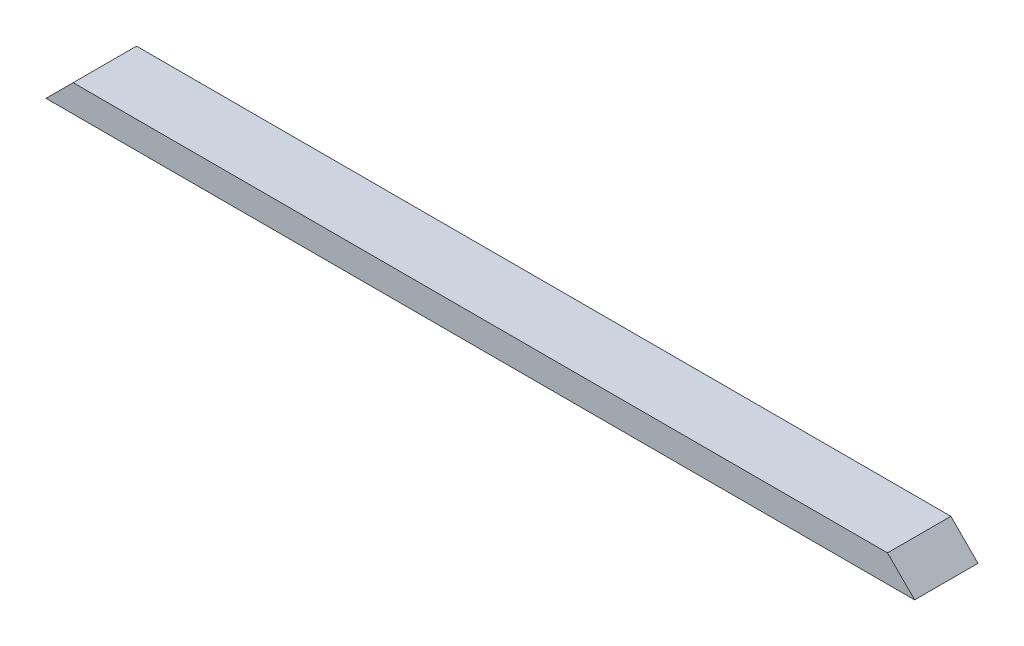
ISO-10303-21;
HEADER;
FILE_DESCRIPTION(('STEP AP214'),'2;1');
FILE_NAME('part.step','',(''),(''),'','','');
FILE_SCHEMA(('AUTOMOTIVE_DESIGN { 1 0 10303 214 1 1 1 1 }'));
ENDSEC;
DATA;
#1=APPLICATION_CONTEXT('core data for automotive mechanical design processes');
#2=APPLICATION_PROTOCOL_DEFINITION('international standard','automotive_design',2000,#1);
#3=PRODUCT_CONTEXT('',#1,'mechanical');
#4=PRODUCT('Part','Part','',(#3));
#5=PRODUCT_RELATED_PRODUCT_CATEGORY('part','',(#4));
#6=PRODUCT_DEFINITION_FORMATION('','',#4);
#7=PRODUCT_DEFINITION_CONTEXT('part definition',#1,'design');
#8=PRODUCT_DEFINITION('design','',#6,#7);
#9=PRODUCT_DEFINITION_SHAPE('','',#8);
#10=(LENGTH_UNIT() NAMED_UNIT(*) SI_UNIT(.MILLI.,.METRE.));
#11=(NAMED_UNIT(*) PLANE_ANGLE_UNIT() SI_UNIT($,.RADIAN.));
#12=(NAMED_UNIT(*) SI_UNIT($,.STERADIAN.) SOLID_ANGLE_UNIT());
#13=UNCERTAINTY_MEASURE_WITH_UNIT(LENGTH_MEASURE(1.E-05),#10,'distance_accuracy_value','');
#14=(GEOMETRIC_REPRESENTATION_CONTEXT(3) GLOBAL_UNCERTAINTY_ASSIGNED_CONTEXT((#13)) GLOBAL_UNIT_ASSIGNED_CONTEXT((#10,
#11,#12)) REPRESENTATION_CONTEXT('',''));
#15=CARTESIAN_POINT('',(0.,0.,0.));
#16=DIRECTION('',(0.,0.,1.));
#17=DIRECTION('',(1.,0.,0.));
#18=AXIS2_PLACEMENT_3D('',#15,#16,#17);
#19=CARTESIAN_POINT('',(0.,38.1,0.));
#20=DIRECTION('',(0.,0.,-1.));
#21=DIRECTION('',(-1.,0.,0.));
#22=AXIS2_PLACEMENT_3D('',#19,#20,#21);
#23=PLANE('',#22);
#24=DIRECTION('',(1.,0.,0.));
#25=VECTOR('',#24,1.);
#26=CARTESIAN_POINT('',(0.,38.1,0.));
#27=LINE('',#26,#25);
#28=CARTESIAN_POINT('',(38.1,38.1,0.));
#29=VERTEX_POINT('',#28);
#30=CARTESIAN_POINT('',(1181.1,38.1000000000001,0.));
#31=VERTEX_POINT('',#30);
#32=EDGE_CURVE('E47',#29,#31,#27,.T.);
#33=ORIENTED_EDGE('',*,*,#32,.F.);
#34=DIRECTION('',(0.707106781186547,0.707106781186547,0.));
#35=VECTOR('',#34,1.);
#36=CARTESIAN_POINT('',(0.,0.,0.));
#37=LINE('',#36,#35);
#38=CARTESIAN_POINT('',(0.,0.,0.));
#39=VERTEX_POINT('',#38);
#40=EDGE_CURVE('E82',#39,#29,#37,.T.);
#41=ORIENTED_EDGE('',*,*,#40,.F.);
#42=DIRECTION('',(1.,0.,0.));
#43=VECTOR('',#42,1.);
#44=CARTESIAN_POINT('',(0.,0.,0.));
#45=LINE('',#44,#43);
#46=CARTESIAN_POINT('',(1219.2,0.,0.));
#47=VERTEX_POINT('',#46);
#48=EDGE_CURVE('E87',#39,#47,#45,.T.);
#49=ORIENTED_EDGE('',*,*,#48,.T.);
#50=DIRECTION('',(0.707106781186547,-0.707106781186548,0.));
#51=VECTOR('',#50,1.);
#52=CARTESIAN_POINT('',(1181.1,38.1000000000001,0.));
#53=LINE('',#52,#51);
#54=EDGE_CURVE('E63',#31,#47,#53,.T.);
#55=ORIENTED_EDGE('',*,*,#54,.F.);
#56=EDGE_LOOP('',(#33,#41,#49,#55));
#57=FACE_BOUND('',#56,.T.);
#58=ADVANCED_FACE('F39',(#57),#23,.F.);
#59=CARTESIAN_POINT('',(0.,38.1,-88.9));
#60=DIRECTION('',(0.,0.,1.));
#61=DIRECTION('',(1.,0.,0.));
#62=AXIS2_PLACEMENT_3D('',#59,#60,#61);
#63=PLANE('',#62);
#64=DIRECTION('',(-1.,0.,0.));
#65=VECTOR('',#64,1.);
#66=CARTESIAN_POINT('',(0.,0.,-88.9));
#67=LINE('',#66,#65);
#68=CARTESIAN_POINT('',(1219.2,0.,-88.9));
#69=VERTEX_POINT('',#68);
#70=CARTESIAN_POINT('',(0.,0.,-88.9));
#71=VERTEX_POINT('',#70);
#72=EDGE_CURVE('E42',#69,#71,#67,.T.);
#73=ORIENTED_EDGE('',*,*,#72,.T.);
#74=DIRECTION('',(0.707106781186547,0.707106781186547,0.));
#75=VECTOR('',#74,1.);
#76=CARTESIAN_POINT('',(0.,0.,-88.9));
#77=LINE('',#76,#75);
#78=CARTESIAN_POINT('',(38.1,38.1,-88.9));
#79=VERTEX_POINT('',#78);
#80=EDGE_CURVE('E55',#71,#79,#77,.T.);
#81=ORIENTED_EDGE('',*,*,#80,.T.);
#82=DIRECTION('',(-1.,0.,0.));
#83=VECTOR('',#82,1.);
#84=CARTESIAN_POINT('',(0.,38.1,-88.9));
#85=LINE('',#84,#83);
#86=CARTESIAN_POINT('',(1181.1,38.1000000000001,-88.9));
#87=VERTEX_POINT('',#86);
#88=EDGE_CURVE('E11',#87,#79,#85,.T.);
#89=ORIENTED_EDGE('',*,*,#88,.F.);
#90=DIRECTION('',(0.707106781186547,-0.707106781186548,0.));
#91=VECTOR('',#90,1.);
#92=CARTESIAN_POINT('',(1181.1,38.1000000000001,-88.9));
#93=LINE('',#92,#91);
#94=EDGE_CURVE('E100',#87,#69,#93,.T.);
#95=ORIENTED_EDGE('',*,*,#94,.T.);
#96=EDGE_LOOP('',(#73,#81,#89,#95));
#97=FACE_BOUND('',#96,.T.);
#98=ADVANCED_FACE('F109',(#97),#63,.F.);
#99=CARTESIAN_POINT('',(0.,38.1,0.));
#100=DIRECTION('',(0.,-1.,0.));
#101=DIRECTION('',(0.,0.,-1.));
#102=AXIS2_PLACEMENT_3D('',#99,#100,#101);
#103=PLANE('',#102);
#104=ORIENTED_EDGE('',*,*,#88,.T.);
#105=DIRECTION('',(0.,0.,1.));
#106=VECTOR('',#105,1.);
#107=CARTESIAN_POINT('',(38.1,38.1,-88.9));
#108=LINE('',#107,#106);
#109=EDGE_CURVE('E88',#79,#29,#108,.T.);
#110=ORIENTED_EDGE('',*,*,#109,.T.);
#111=ORIENTED_EDGE('',*,*,#32,.T.);
#112=DIRECTION('',(0.,0.,1.));
#113=VECTOR('',#112,1.);
#114=CARTESIAN_POINT('',(1181.1,38.1000000000001,-88.9));
#115=LINE('',#114,#113);
#116=EDGE_CURVE('E103',#87,#31,#115,.T.);
#117=ORIENTED_EDGE('',*,*,#116,.F.);
#118=EDGE_LOOP('',(#104,#110,#111,#117));
#119=FACE_BOUND('',#118,.T.);
#120=ADVANCED_FACE('F112',(#119),#103,.F.);
#121=CARTESIAN_POINT('',(0.,0.,0.));
#122=DIRECTION('',(0.,-1.,0.));
#123=DIRECTION('',(0.,0.,-1.));
#124=AXIS2_PLACEMENT_3D('',#121,#122,#123);
#125=PLANE('',#124);
#126=DIRECTION('',(0.,0.,1.));
#127=VECTOR('',#126,1.);
#128=CARTESIAN_POINT('',(0.,0.,0.));
#129=LINE('',#128,#127);
#130=EDGE_CURVE('E79',#71,#39,#129,.T.);
#131=ORIENTED_EDGE('',*,*,#130,.F.);
#132=ORIENTED_EDGE('',*,*,#72,.F.);
#133=DIRECTION('',(0.,0.,-1.));
#134=VECTOR('',#133,1.);
#135=CARTESIAN_POINT('',(1219.2,0.,0.));
#136=LINE('',#135,#134);
#137=EDGE_CURVE('E96',#47,#69,#136,.T.);
#138=ORIENTED_EDGE('',*,*,#137,.F.);
#139=ORIENTED_EDGE('',*,*,#48,.F.);
#140=EDGE_LOOP('',(#131,#132,#138,#139));
#141=FACE_BOUND('',#140,.T.);
#142=ADVANCED_FACE('F95',(#141),#125,.T.);
#143=CARTESIAN_POINT('',(1181.1,38.1000000000001,-88.9));
#144=DIRECTION('',(-0.707106781186548,-0.707106781186547,0.));
#145=DIRECTION('',(0.707106781186547,-0.707106781186548,0.));
#146=AXIS2_PLACEMENT_3D('',#143,#144,#145);
#147=PLANE('',#146);
#148=ORIENTED_EDGE('',*,*,#54,.T.);
#149=ORIENTED_EDGE('',*,*,#137,.T.);
#150=ORIENTED_EDGE('',*,*,#94,.F.);
#151=ORIENTED_EDGE('',*,*,#116,.T.);
#152=EDGE_LOOP('',(#148,#149,#150,#151));
#153=FACE_BOUND('',#152,.T.);
#154=ADVANCED_FACE('F113',(#153),#147,.F.);
#155=CARTESIAN_POINT('',(0.,0.,-88.9));
#156=DIRECTION('',(0.707106781186547,-0.707106781186547,0.));
#157=DIRECTION('',(0.707106781186548,0.707106781186548,0.));
#158=AXIS2_PLACEMENT_3D('',#155,#156,#157);
#159=PLANE('',#158);
#160=ORIENTED_EDGE('',*,*,#40,.T.);
#161=ORIENTED_EDGE('',*,*,#109,.F.);
#162=ORIENTED_EDGE('',*,*,#80,.F.);
#163=ORIENTED_EDGE('',*,*,#130,.T.);
#164=EDGE_LOOP('',(#160,#161,#162,#163));
#165=FACE_BOUND('',#164,.T.);
#166=ADVANCED_FACE('F81',(#165),#159,.F.);
#167=CLOSED_SHELL('',(#58,#98,#120,#142,#154,#166));
#168=MANIFOLD_SOLID_BREP('B2',#167);
#169=ADVANCED_BREP_SHAPE_REPRESENTATION('',(#18,#168),#14);
#170=SHAPE_DEFINITION_REPRESENTATION(#9,#169);
ENDSEC;
END-ISO-10303-21;
